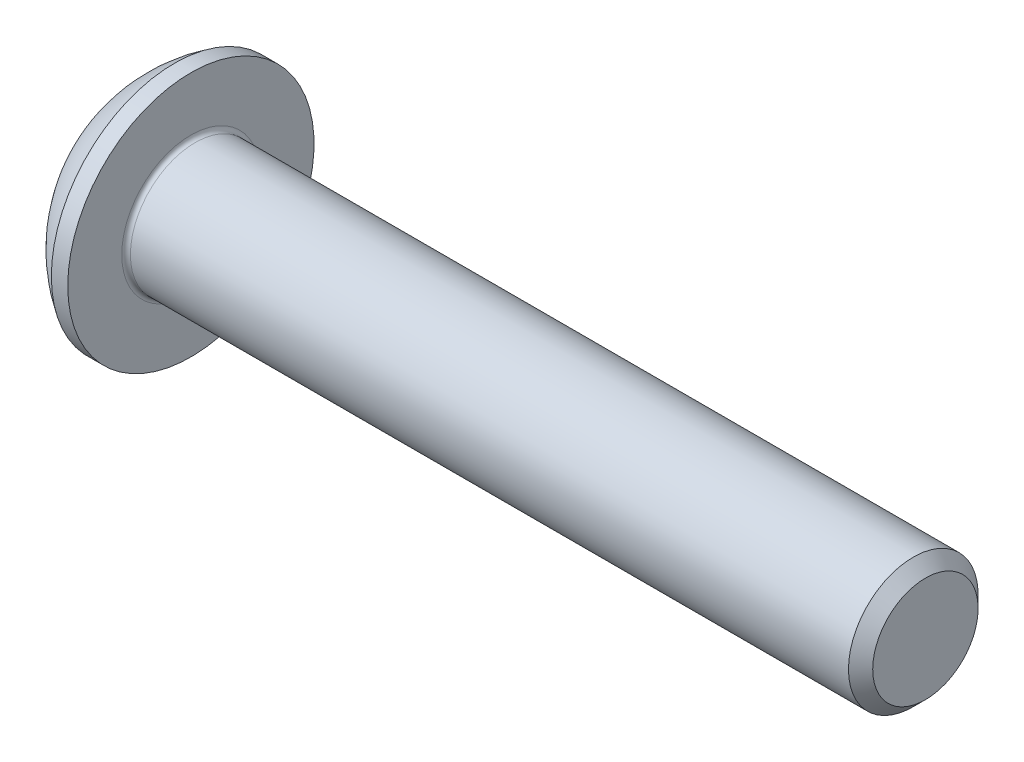
ISO-10303-21;
HEADER;
FILE_DESCRIPTION(('STEP AP214'),'2;1');
FILE_NAME('part.step','',(''),(''),'','','');
FILE_SCHEMA(('AUTOMOTIVE_DESIGN { 1 0 10303 214 1 1 1 1 }'));
ENDSEC;
DATA;
#1=APPLICATION_CONTEXT('core data for automotive mechanical design processes');
#2=APPLICATION_PROTOCOL_DEFINITION('international standard','automotive_design',2000,#1);
#3=PRODUCT_CONTEXT('',#1,'mechanical');
#4=PRODUCT('Part','Part','',(#3));
#5=PRODUCT_RELATED_PRODUCT_CATEGORY('part','',(#4));
#6=PRODUCT_DEFINITION_FORMATION('','',#4);
#7=PRODUCT_DEFINITION_CONTEXT('part definition',#1,'design');
#8=PRODUCT_DEFINITION('design','',#6,#7);
#9=PRODUCT_DEFINITION_SHAPE('','',#8);
#10=(LENGTH_UNIT() NAMED_UNIT(*) SI_UNIT(.MILLI.,.METRE.));
#11=(NAMED_UNIT(*) PLANE_ANGLE_UNIT() SI_UNIT($,.RADIAN.));
#12=(NAMED_UNIT(*) SI_UNIT($,.STERADIAN.) SOLID_ANGLE_UNIT());
#13=UNCERTAINTY_MEASURE_WITH_UNIT(LENGTH_MEASURE(1.E-05),#10,'distance_accuracy_value','');
#14=(GEOMETRIC_REPRESENTATION_CONTEXT(3) GLOBAL_UNCERTAINTY_ASSIGNED_CONTEXT((#13)) GLOBAL_UNIT_ASSIGNED_CONTEXT((#10,
#11,#12)) REPRESENTATION_CONTEXT('',''));
#15=CARTESIAN_POINT('',(0.,0.,0.));
#16=DIRECTION('',(0.,0.,1.));
#17=DIRECTION('',(1.,0.,0.));
#18=AXIS2_PLACEMENT_3D('',#15,#16,#17);
#19=CARTESIAN_POINT('',(0.,0.,0.));
#20=DIRECTION('',(-1.,0.,0.));
#21=DIRECTION('',(0.,0.,1.));
#22=AXIS2_PLACEMENT_3D('',#19,#20,#21);
#23=PLANE('',#22);
#24=CARTESIAN_POINT('',(0.,0.,0.));
#25=DIRECTION('',(-1.,0.,0.));
#26=DIRECTION('',(0.,0.,1.));
#27=AXIS2_PLACEMENT_3D('',#24,#25,#26);
#28=CIRCLE('',#27,1.425);
#29=CARTESIAN_POINT('',(0.,0.,1.425));
#30=VERTEX_POINT('',#29);
#31=EDGE_CURVE('E157',#30,#30,#28,.T.);
#32=ORIENTED_EDGE('',*,*,#31,.T.);
#33=EDGE_LOOP('',(#32));
#34=FACE_BOUND('',#33,.T.);
#35=DIRECTION('',(0.,-0.999999999999999,0.));
#36=VECTOR('',#35,1.);
#37=CARTESIAN_POINT('',(0.,-0.577350269189622,1.));
#38=LINE('',#37,#36);
#39=CARTESIAN_POINT('',(0.,0.577350269189627,0.999999999999998));
#40=VERTEX_POINT('',#39);
#41=CARTESIAN_POINT('',(0.,-0.577350269189622,1.));
#42=VERTEX_POINT('',#41);
#43=EDGE_CURVE('E47',#40,#42,#38,.T.);
#44=ORIENTED_EDGE('',*,*,#43,.T.);
#45=DIRECTION('',(0.,-0.499999999999999,-0.86602540378444));
#46=VECTOR('',#45,1.);
#47=CARTESIAN_POINT('',(0.,-1.15470053837925,0.));
#48=LINE('',#47,#46);
#49=CARTESIAN_POINT('',(0.,-1.15470053837925,0.));
#50=VERTEX_POINT('',#49);
#51=EDGE_CURVE('E250',#42,#50,#48,.T.);
#52=ORIENTED_EDGE('',*,*,#51,.T.);
#53=DIRECTION('',(0.,0.499999999999999,-0.86602540378444));
#54=VECTOR('',#53,1.);
#55=CARTESIAN_POINT('',(0.,-0.577350269189624,-1.));
#56=LINE('',#55,#54);
#57=CARTESIAN_POINT('',(0.,-0.577350269189624,-1.));
#58=VERTEX_POINT('',#57);
#59=EDGE_CURVE('E132',#50,#58,#56,.T.);
#60=ORIENTED_EDGE('',*,*,#59,.T.);
#61=DIRECTION('',(0.,0.999999999999999,0.));
#62=VECTOR('',#61,1.);
#63=CARTESIAN_POINT('',(0.,0.577350269189631,-1.00000000000001));
#64=LINE('',#63,#62);
#65=CARTESIAN_POINT('',(0.,0.577350269189631,-1.00000000000001));
#66=VERTEX_POINT('',#65);
#67=EDGE_CURVE('E253',#58,#66,#64,.T.);
#68=ORIENTED_EDGE('',*,*,#67,.T.);
#69=DIRECTION('',(0.,0.5,0.86602540378444));
#70=VECTOR('',#69,1.);
#71=CARTESIAN_POINT('',(0.,1.15470053837926,0.));
#72=LINE('',#71,#70);
#73=CARTESIAN_POINT('',(0.,1.15470053837926,0.));
#74=VERTEX_POINT('',#73);
#75=EDGE_CURVE('E255',#66,#74,#72,.T.);
#76=ORIENTED_EDGE('',*,*,#75,.T.);
#77=DIRECTION('',(0.,-0.5,0.86602540378444));
#78=VECTOR('',#77,1.);
#79=CARTESIAN_POINT('',(0.,0.577350269189627,0.999999999999998));
#80=LINE('',#79,#78);
#81=EDGE_CURVE('E257',#74,#40,#80,.T.);
#82=ORIENTED_EDGE('',*,*,#81,.T.);
#83=EDGE_LOOP('',(#44,#52,#60,#68,#76,#82));
#84=FACE_BOUND('',#83,.T.);
#85=ADVANCED_FACE('F32',(#34,#84),#23,.T.);
#86=CARTESIAN_POINT('',(3.03337598425199,0.,0.));
#87=DIRECTION('',(-1.,0.,0.));
#88=DIRECTION('',(0.,0.999999999999999,0.));
#89=AXIS2_PLACEMENT_3D('',#86,#87,#88);
#90=SPHERICAL_SURFACE('',#89,3.35141684393879);
#91=CARTESIAN_POINT('',(1.27,0.,0.));
#92=DIRECTION('',(-1.,0.,0.));
#93=DIRECTION('',(0.,0.,1.));
#94=AXIS2_PLACEMENT_3D('',#91,#92,#93);
#95=CIRCLE('',#94,2.85);
#96=CARTESIAN_POINT('',(1.27,0.,2.85));
#97=VERTEX_POINT('',#96);
#98=EDGE_CURVE('E154',#97,#97,#95,.T.);
#99=ORIENTED_EDGE('',*,*,#98,.T.);
#100=EDGE_LOOP('',(#99));
#101=FACE_BOUND('',#100,.T.);
#102=ORIENTED_EDGE('',*,*,#31,.F.);
#103=EDGE_LOOP('',(#102));
#104=FACE_BOUND('',#103,.T.);
#105=ADVANCED_FACE('F178',(#101,#104),#90,.T.);
#106=CARTESIAN_POINT('',(0.,0.,0.));
#107=DIRECTION('',(-1.,0.,0.));
#108=DIRECTION('',(0.,0.,1.));
#109=AXIS2_PLACEMENT_3D('',#106,#107,#108);
#110=CYLINDRICAL_SURFACE('',#109,2.85);
#111=ORIENTED_EDGE('',*,*,#98,.F.);
#112=EDGE_LOOP('',(#111));
#113=FACE_BOUND('',#112,.T.);
#114=CARTESIAN_POINT('',(1.65,0.,0.));
#115=DIRECTION('',(-1.,0.,0.));
#116=DIRECTION('',(0.,0.,1.));
#117=AXIS2_PLACEMENT_3D('',#114,#115,#116);
#118=CIRCLE('',#117,2.85);
#119=CARTESIAN_POINT('',(1.65,0.,2.85));
#120=VERTEX_POINT('',#119);
#121=EDGE_CURVE('E151',#120,#120,#118,.T.);
#122=ORIENTED_EDGE('',*,*,#121,.T.);
#123=EDGE_LOOP('',(#122));
#124=FACE_BOUND('',#123,.T.);
#125=ADVANCED_FACE('F183',(#113,#124),#110,.T.);
#126=CARTESIAN_POINT('',(1.65,1.49999999999999,0.));
#127=DIRECTION('',(-1.,0.,0.));
#128=DIRECTION('',(0.,0.,1.));
#129=AXIS2_PLACEMENT_3D('',#126,#127,#128);
#130=PLANE('',#129);
#131=CARTESIAN_POINT('',(1.65,0.,0.));
#132=DIRECTION('',(-1.,0.,0.));
#133=DIRECTION('',(0.,0.,1.));
#134=AXIS2_PLACEMENT_3D('',#131,#132,#133);
#135=CIRCLE('',#134,1.6);
#136=CARTESIAN_POINT('',(1.65,0.,1.6));
#137=VERTEX_POINT('',#136);
#138=EDGE_CURVE('E40',#137,#137,#135,.T.);
#139=ORIENTED_EDGE('',*,*,#138,.T.);
#140=EDGE_LOOP('',(#139));
#141=FACE_BOUND('',#140,.T.);
#142=ORIENTED_EDGE('',*,*,#121,.F.);
#143=EDGE_LOOP('',(#142));
#144=FACE_BOUND('',#143,.T.);
#145=ADVANCED_FACE('F162',(#141,#144),#130,.F.);
#146=CARTESIAN_POINT('',(0.,0.,0.));
#147=DIRECTION('',(-1.,0.,0.));
#148=DIRECTION('',(0.,0.,1.));
#149=AXIS2_PLACEMENT_3D('',#146,#147,#148);
#150=CYLINDRICAL_SURFACE('',#149,1.5);
#151=CARTESIAN_POINT('',(1.75000000000001,0.,0.));
#152=DIRECTION('',(-1.,0.,0.));
#153=DIRECTION('',(0.,0.,1.));
#154=AXIS2_PLACEMENT_3D('',#151,#152,#153);
#155=CIRCLE('',#154,1.5);
#156=CARTESIAN_POINT('',(1.75000000000001,0.,1.5));
#157=VERTEX_POINT('',#156);
#158=EDGE_CURVE('E11',#157,#157,#155,.F.);
#159=ORIENTED_EDGE('',*,*,#158,.T.);
#160=EDGE_LOOP('',(#159));
#161=FACE_BOUND('',#160,.T.);
#162=CARTESIAN_POINT('',(18.3695,0.,0.));
#163=DIRECTION('',(-1.,0.,0.));
#164=DIRECTION('',(0.,0.,1.));
#165=AXIS2_PLACEMENT_3D('',#162,#163,#164);
#166=CIRCLE('',#165,1.5);
#167=CARTESIAN_POINT('',(18.3695,0.,1.5));
#168=VERTEX_POINT('',#167);
#169=EDGE_CURVE('E148',#168,#168,#166,.T.);
#170=ORIENTED_EDGE('',*,*,#169,.T.);
#171=EDGE_LOOP('',(#170));
#172=FACE_BOUND('',#171,.T.);
#173=ADVANCED_FACE('F192',(#161,#172),#150,.T.);
#174=CARTESIAN_POINT('',(18.65,0.,0.));
#175=DIRECTION('',(-1.,0.,0.));
#176=DIRECTION('',(0.,0.,1.));
#177=AXIS2_PLACEMENT_3D('',#174,#175,#176);
#178=CONICAL_SURFACE('',#177,1.2195,0.785398163397443);
#179=ORIENTED_EDGE('',*,*,#169,.F.);
#180=EDGE_LOOP('',(#179));
#181=FACE_BOUND('',#180,.T.);
#182=CARTESIAN_POINT('',(18.65,0.,0.));
#183=DIRECTION('',(-1.,0.,0.));
#184=DIRECTION('',(0.,0.,1.));
#185=AXIS2_PLACEMENT_3D('',#182,#183,#184);
#186=CIRCLE('',#185,1.2195);
#187=CARTESIAN_POINT('',(18.65,0.,1.2195));
#188=VERTEX_POINT('',#187);
#189=EDGE_CURVE('E144',#188,#188,#186,.T.);
#190=ORIENTED_EDGE('',*,*,#189,.T.);
#191=EDGE_LOOP('',(#190));
#192=FACE_BOUND('',#191,.T.);
#193=ADVANCED_FACE('F173',(#181,#192),#178,.T.);
#194=CARTESIAN_POINT('',(18.65,0.,0.));
#195=DIRECTION('',(-1.,0.,0.));
#196=DIRECTION('',(0.,0.,1.));
#197=AXIS2_PLACEMENT_3D('',#194,#195,#196);
#198=PLANE('',#197);
#199=ORIENTED_EDGE('',*,*,#189,.F.);
#200=EDGE_LOOP('',(#199));
#201=FACE_BOUND('',#200,.T.);
#202=ADVANCED_FACE('F166',(#201),#198,.F.);
#203=CARTESIAN_POINT('',(1.75000000000001,0.,0.));
#204=DIRECTION('',(-1.,0.,0.));
#205=DIRECTION('',(0.,0.,1.));
#206=AXIS2_PLACEMENT_3D('',#203,#204,#205);
#207=TOROIDAL_SURFACE('',#206,1.6,0.1);
#208=ORIENTED_EDGE('',*,*,#158,.F.);
#209=EDGE_LOOP('',(#208));
#210=FACE_BOUND('',#209,.T.);
#211=ORIENTED_EDGE('',*,*,#138,.F.);
#212=EDGE_LOOP('',(#211));
#213=FACE_BOUND('',#212,.T.);
#214=ADVANCED_FACE('F34',(#210,#213),#207,.F.);
#215=CARTESIAN_POINT('',(1.04000000000001,-1.15470053837925,0.));
#216=DIRECTION('',(0.,0.866025403784439,-0.5));
#217=DIRECTION('',(0.,0.499999999999999,0.86602540378444));
#218=AXIS2_PLACEMENT_3D('',#215,#216,#217);
#219=PLANE('',#218);
#220=DIRECTION('',(0.,-0.499999999999999,-0.86602540378444));
#221=VECTOR('',#220,1.);
#222=CARTESIAN_POINT('',(1.04000000000001,-1.15470053837925,0.));
#223=LINE('',#222,#221);
#224=CARTESIAN_POINT('',(1.04,-0.577350269189622,1.));
#225=VERTEX_POINT('',#224);
#226=CARTESIAN_POINT('',(1.04,-0.866025403784438,0.499999999999997));
#227=VERTEX_POINT('',#226);
#228=EDGE_CURVE('E115',#225,#227,#223,.T.);
#229=ORIENTED_EDGE('',*,*,#228,.T.);
#230=CARTESIAN_POINT('',(1.04000000000001,-1.15470053837925,0.));
#231=VERTEX_POINT('',#230);
#232=EDGE_CURVE('E108',#227,#231,#223,.T.);
#233=ORIENTED_EDGE('',*,*,#232,.T.);
#234=DIRECTION('',(-1.,0.,0.));
#235=VECTOR('',#234,1.);
#236=CARTESIAN_POINT('',(1.04000000000001,-1.15470053837925,0.));
#237=LINE('',#236,#235);
#238=EDGE_CURVE('E112',#231,#50,#237,.T.);
#239=ORIENTED_EDGE('',*,*,#238,.T.);
#240=ORIENTED_EDGE('',*,*,#51,.F.);
#241=DIRECTION('',(-1.,0.,0.));
#242=VECTOR('',#241,1.);
#243=CARTESIAN_POINT('',(1.04,-0.577350269189622,1.));
#244=LINE('',#243,#242);
#245=EDGE_CURVE('E240',#225,#42,#244,.T.);
#246=ORIENTED_EDGE('',*,*,#245,.F.);
#247=EDGE_LOOP('',(#229,#233,#239,#240,#246));
#248=FACE_BOUND('',#247,.T.);
#249=ADVANCED_FACE('F110',(#248),#219,.T.);
#250=CARTESIAN_POINT('',(1.04,-0.577350269189622,-1.00000000000001));
#251=DIRECTION('',(0.,0.866025403784438,0.5));
#252=DIRECTION('',(0.,-0.499999999999999,0.86602540378444));
#253=AXIS2_PLACEMENT_3D('',#250,#251,#252);
#254=PLANE('',#253);
#255=DIRECTION('',(0.,0.499999999999999,-0.86602540378444));
#256=VECTOR('',#255,1.);
#257=CARTESIAN_POINT('',(1.04,-0.577350269189622,-1.00000000000001));
#258=LINE('',#257,#256);
#259=CARTESIAN_POINT('',(1.04,-0.866025403784437,-0.500000000000002));
#260=VERTEX_POINT('',#259);
#261=EDGE_CURVE('E120',#231,#260,#258,.T.);
#262=ORIENTED_EDGE('',*,*,#261,.T.);
#263=CARTESIAN_POINT('',(1.04,-0.577350269189622,-1.00000000000001));
#264=VERTEX_POINT('',#263);
#265=EDGE_CURVE('E127',#260,#264,#258,.T.);
#266=ORIENTED_EDGE('',*,*,#265,.T.);
#267=DIRECTION('',(-1.,0.,0.));
#268=VECTOR('',#267,1.);
#269=CARTESIAN_POINT('',(1.04,-0.577350269189622,-1.00000000000001));
#270=LINE('',#269,#268);
#271=EDGE_CURVE('E134',#264,#58,#270,.T.);
#272=ORIENTED_EDGE('',*,*,#271,.T.);
#273=ORIENTED_EDGE('',*,*,#59,.F.);
#274=ORIENTED_EDGE('',*,*,#238,.F.);
#275=EDGE_LOOP('',(#262,#266,#272,#273,#274));
#276=FACE_BOUND('',#275,.T.);
#277=ADVANCED_FACE('F130',(#276),#254,.T.);
#278=CARTESIAN_POINT('',(1.03999999999999,0.577350269189628,-0.999999999999998));
#279=DIRECTION('',(0.,0.,1.));
#280=DIRECTION('',(1.,0.,0.));
#281=AXIS2_PLACEMENT_3D('',#278,#279,#280);
#282=PLANE('',#281);
#283=DIRECTION('',(0.,0.999999999999999,0.));
#284=VECTOR('',#283,1.);
#285=CARTESIAN_POINT('',(1.03999999999999,0.577350269189628,-0.999999999999998));
#286=LINE('',#285,#284);
#287=CARTESIAN_POINT('',(1.04,0.,-1.));
#288=VERTEX_POINT('',#287);
#289=EDGE_CURVE('E276',#264,#288,#286,.T.);
#290=ORIENTED_EDGE('',*,*,#289,.T.);
#291=CARTESIAN_POINT('',(1.03999999999999,0.577350269189628,-0.999999999999998));
#292=VERTEX_POINT('',#291);
#293=EDGE_CURVE('E126',#288,#292,#286,.T.);
#294=ORIENTED_EDGE('',*,*,#293,.T.);
#295=DIRECTION('',(-1.,0.,0.));
#296=VECTOR('',#295,1.);
#297=CARTESIAN_POINT('',(1.03999999999999,0.577350269189628,-0.999999999999998));
#298=LINE('',#297,#296);
#299=EDGE_CURVE('E139',#292,#66,#298,.T.);
#300=ORIENTED_EDGE('',*,*,#299,.T.);
#301=ORIENTED_EDGE('',*,*,#67,.F.);
#302=ORIENTED_EDGE('',*,*,#271,.F.);
#303=EDGE_LOOP('',(#290,#294,#300,#301,#302));
#304=FACE_BOUND('',#303,.T.);
#305=ADVANCED_FACE('F206',(#304),#282,.T.);
#306=CARTESIAN_POINT('',(1.04000000000001,1.15470053837925,0.));
#307=DIRECTION('',(0.,-0.866025403784438,0.5));
#308=DIRECTION('',(0.,-0.5,-0.86602540378444));
#309=AXIS2_PLACEMENT_3D('',#306,#307,#308);
#310=PLANE('',#309);
#311=DIRECTION('',(0.,0.5,0.86602540378444));
#312=VECTOR('',#311,1.);
#313=CARTESIAN_POINT('',(1.04000000000001,1.15470053837925,0.));
#314=LINE('',#313,#312);
#315=CARTESIAN_POINT('',(1.04,0.866025403784442,-0.500000000000003));
#316=VERTEX_POINT('',#315);
#317=EDGE_CURVE('E282',#292,#316,#314,.T.);
#318=ORIENTED_EDGE('',*,*,#317,.T.);
#319=CARTESIAN_POINT('',(1.04000000000001,1.15470053837925,0.));
#320=VERTEX_POINT('',#319);
#321=EDGE_CURVE('E280',#316,#320,#314,.T.);
#322=ORIENTED_EDGE('',*,*,#321,.T.);
#323=DIRECTION('',(-1.,0.,0.));
#324=VECTOR('',#323,1.);
#325=CARTESIAN_POINT('',(1.04000000000001,1.15470053837925,0.));
#326=LINE('',#325,#324);
#327=EDGE_CURVE('E262',#320,#74,#326,.T.);
#328=ORIENTED_EDGE('',*,*,#327,.T.);
#329=ORIENTED_EDGE('',*,*,#75,.F.);
#330=ORIENTED_EDGE('',*,*,#299,.F.);
#331=EDGE_LOOP('',(#318,#322,#328,#329,#330));
#332=FACE_BOUND('',#331,.T.);
#333=ADVANCED_FACE('F209',(#332),#310,.T.);
#334=CARTESIAN_POINT('',(1.04,0.577350269189628,0.999999999999999));
#335=DIRECTION('',(0.,-0.866025403784438,-0.5));
#336=DIRECTION('',(0.,0.499999999999999,-0.866025403784439));
#337=AXIS2_PLACEMENT_3D('',#334,#335,#336);
#338=PLANE('',#337);
#339=DIRECTION('',(0.,-0.5,0.86602540378444));
#340=VECTOR('',#339,1.);
#341=CARTESIAN_POINT('',(1.04,0.577350269189628,0.999999999999999));
#342=LINE('',#341,#340);
#343=CARTESIAN_POINT('',(1.04,0.866025403784442,0.499999999999997));
#344=VERTEX_POINT('',#343);
#345=EDGE_CURVE('E246',#320,#344,#342,.T.);
#346=ORIENTED_EDGE('',*,*,#345,.T.);
#347=CARTESIAN_POINT('',(1.04,0.577350269189628,0.999999999999999));
#348=VERTEX_POINT('',#347);
#349=EDGE_CURVE('E238',#344,#348,#342,.T.);
#350=ORIENTED_EDGE('',*,*,#349,.T.);
#351=DIRECTION('',(-1.,0.,0.));
#352=VECTOR('',#351,1.);
#353=CARTESIAN_POINT('',(1.04,0.577350269189628,0.999999999999999));
#354=LINE('',#353,#352);
#355=EDGE_CURVE('E244',#348,#40,#354,.T.);
#356=ORIENTED_EDGE('',*,*,#355,.T.);
#357=ORIENTED_EDGE('',*,*,#81,.F.);
#358=ORIENTED_EDGE('',*,*,#327,.F.);
#359=EDGE_LOOP('',(#346,#350,#356,#357,#358));
#360=FACE_BOUND('',#359,.T.);
#361=ADVANCED_FACE('F213',(#360),#338,.T.);
#362=CARTESIAN_POINT('',(1.04,-0.577350269189622,1.));
#363=DIRECTION('',(0.,0.,-1.));
#364=DIRECTION('',(-1.,0.,0.));
#365=AXIS2_PLACEMENT_3D('',#362,#363,#364);
#366=PLANE('',#365);
#367=DIRECTION('',(0.,-0.999999999999999,0.));
#368=VECTOR('',#367,1.);
#369=CARTESIAN_POINT('',(1.04,-0.577350269189622,1.));
#370=LINE('',#369,#368);
#371=CARTESIAN_POINT('',(1.04,0.,0.999999999999996));
#372=VERTEX_POINT('',#371);
#373=EDGE_CURVE('E55',#348,#372,#370,.T.);
#374=ORIENTED_EDGE('',*,*,#373,.T.);
#375=EDGE_CURVE('E241',#372,#225,#370,.T.);
#376=ORIENTED_EDGE('',*,*,#375,.T.);
#377=ORIENTED_EDGE('',*,*,#245,.T.);
#378=ORIENTED_EDGE('',*,*,#43,.F.);
#379=ORIENTED_EDGE('',*,*,#355,.F.);
#380=EDGE_LOOP('',(#374,#376,#377,#378,#379));
#381=FACE_BOUND('',#380,.T.);
#382=ADVANCED_FACE('F217',(#381),#366,.T.);
#383=CARTESIAN_POINT('',(1.04,-0.577350269189622,1.));
#384=DIRECTION('',(-1.,0.,0.));
#385=DIRECTION('',(0.,0.,1.));
#386=AXIS2_PLACEMENT_3D('',#383,#384,#385);
#387=PLANE('',#386);
#388=ORIENTED_EDGE('',*,*,#373,.F.);
#389=ORIENTED_EDGE('',*,*,#349,.F.);
#390=CARTESIAN_POINT('',(1.03999999999999,0.,0.));
#391=DIRECTION('',(-1.,0.,0.));
#392=DIRECTION('',(0.,0.,1.));
#393=AXIS2_PLACEMENT_3D('',#390,#391,#392);
#394=CIRCLE('',#393,1.);
#395=EDGE_CURVE('E138',#372,#344,#394,.T.);
#396=ORIENTED_EDGE('',*,*,#395,.F.);
#397=EDGE_LOOP('',(#388,#389,#396));
#398=FACE_BOUND('',#397,.T.);
#399=ADVANCED_FACE('F221',(#398),#387,.T.);
#400=ORIENTED_EDGE('',*,*,#345,.F.);
#401=ORIENTED_EDGE('',*,*,#321,.F.);
#402=EDGE_CURVE('E145',#344,#316,#394,.T.);
#403=ORIENTED_EDGE('',*,*,#402,.F.);
#404=EDGE_LOOP('',(#400,#401,#403));
#405=FACE_BOUND('',#404,.T.);
#406=ADVANCED_FACE('F229',(#405),#387,.T.);
#407=ORIENTED_EDGE('',*,*,#317,.F.);
#408=ORIENTED_EDGE('',*,*,#293,.F.);
#409=EDGE_CURVE('E287',#316,#288,#394,.T.);
#410=ORIENTED_EDGE('',*,*,#409,.F.);
#411=EDGE_LOOP('',(#407,#408,#410));
#412=FACE_BOUND('',#411,.T.);
#413=ADVANCED_FACE('F234',(#412),#387,.T.);
#414=ORIENTED_EDGE('',*,*,#289,.F.);
#415=ORIENTED_EDGE('',*,*,#265,.F.);
#416=EDGE_CURVE('E279',#288,#260,#394,.T.);
#417=ORIENTED_EDGE('',*,*,#416,.F.);
#418=EDGE_LOOP('',(#414,#415,#417));
#419=FACE_BOUND('',#418,.T.);
#420=ADVANCED_FACE('F227',(#419),#387,.T.);
#421=ORIENTED_EDGE('',*,*,#261,.F.);
#422=ORIENTED_EDGE('',*,*,#232,.F.);
#423=EDGE_CURVE('E122',#260,#227,#394,.T.);
#424=ORIENTED_EDGE('',*,*,#423,.F.);
#425=EDGE_LOOP('',(#421,#422,#424));
#426=FACE_BOUND('',#425,.T.);
#427=ADVANCED_FACE('F121',(#426),#387,.T.);
#428=ORIENTED_EDGE('',*,*,#228,.F.);
#429=ORIENTED_EDGE('',*,*,#375,.F.);
#430=EDGE_CURVE('E133',#227,#372,#394,.T.);
#431=ORIENTED_EDGE('',*,*,#430,.F.);
#432=EDGE_LOOP('',(#428,#429,#431));
#433=FACE_BOUND('',#432,.T.);
#434=ADVANCED_FACE('F201',(#433),#387,.T.);
#435=CARTESIAN_POINT('',(1.61735026918963,0.,0.));
#436=DIRECTION('',(-1.,0.,0.));
#437=DIRECTION('',(0.,0.,1.));
#438=AXIS2_PLACEMENT_3D('',#435,#436,#437);
#439=CONICAL_SURFACE('',#438,0.,1.04719755119659);
#440=ORIENTED_EDGE('',*,*,#395,.T.);
#441=ORIENTED_EDGE('',*,*,#402,.T.);
#442=ORIENTED_EDGE('',*,*,#409,.T.);
#443=ORIENTED_EDGE('',*,*,#416,.T.);
#444=ORIENTED_EDGE('',*,*,#423,.T.);
#445=ORIENTED_EDGE('',*,*,#430,.T.);
#446=EDGE_LOOP('',(#440,#441,#442,#443,#444,#445));
#447=FACE_BOUND('',#446,.T.);
#448=CARTESIAN_POINT('',(1.61735026918963,0.,0.));
#449=VERTEX_POINT('',#448);
#450=VERTEX_LOOP('',#449);
#451=FACE_BOUND('',#450,.T.);
#452=ADVANCED_FACE('F199',(#447,#451),#439,.F.);
#453=CLOSED_SHELL('',(#85,#105,#125,#145,#173,#193,#202,#214,#249,#277,#305,#333,#361,#382,#399,
#406,#413,#420,#427,#434,#452));
#454=MANIFOLD_SOLID_BREP('B2',#453);
#455=ADVANCED_BREP_SHAPE_REPRESENTATION('',(#18,#454),#14);
#456=SHAPE_DEFINITION_REPRESENTATION(#9,#455);
ENDSEC;
END-ISO-10303-21;
